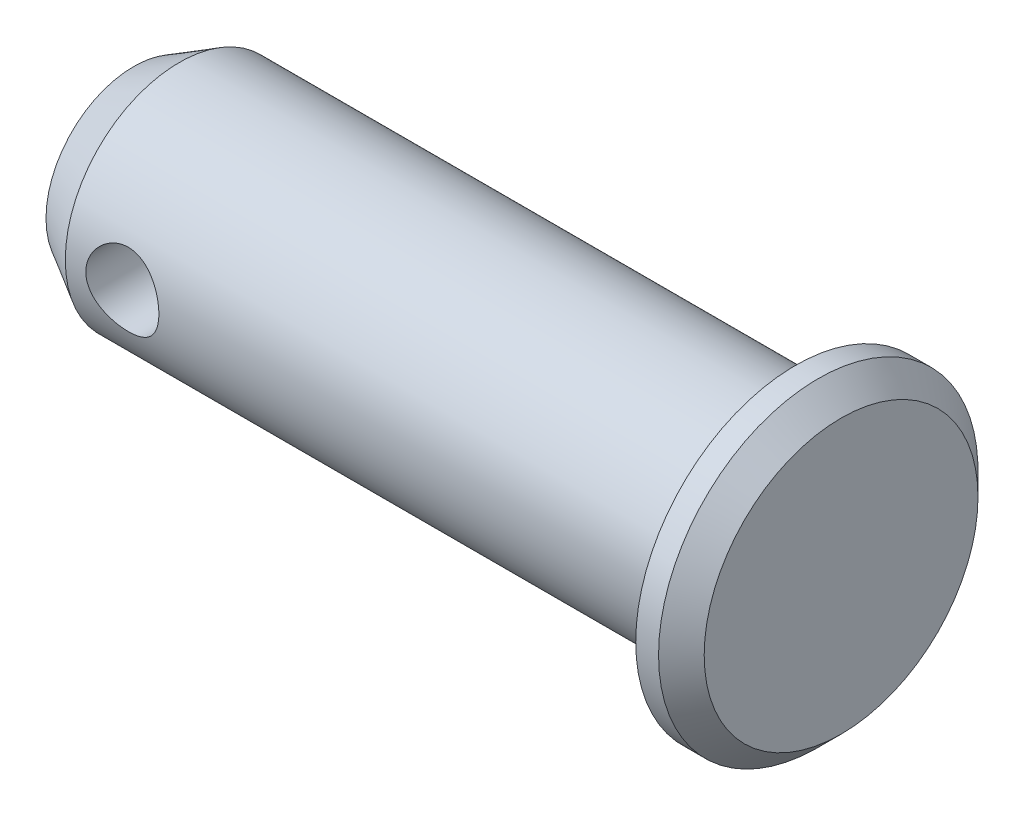
ISO-10303-21;
HEADER;
FILE_DESCRIPTION(('STEP AP214'),'2;1');
FILE_NAME('part.step','',(''),(''),'','','');
FILE_SCHEMA(('AUTOMOTIVE_DESIGN { 1 0 10303 214 1 1 1 1 }'));
ENDSEC;
DATA;
#1=APPLICATION_CONTEXT('core data for automotive mechanical design processes');
#2=APPLICATION_PROTOCOL_DEFINITION('international standard','automotive_design',2000,#1);
#3=PRODUCT_CONTEXT('',#1,'mechanical');
#4=PRODUCT('Part','Part','',(#3));
#5=PRODUCT_RELATED_PRODUCT_CATEGORY('part','',(#4));
#6=PRODUCT_DEFINITION_FORMATION('','',#4);
#7=PRODUCT_DEFINITION_CONTEXT('part definition',#1,'design');
#8=PRODUCT_DEFINITION('design','',#6,#7);
#9=PRODUCT_DEFINITION_SHAPE('','',#8);
#10=(LENGTH_UNIT() NAMED_UNIT(*) SI_UNIT(.MILLI.,.METRE.));
#11=(NAMED_UNIT(*) PLANE_ANGLE_UNIT() SI_UNIT($,.RADIAN.));
#12=(NAMED_UNIT(*) SI_UNIT($,.STERADIAN.) SOLID_ANGLE_UNIT());
#13=UNCERTAINTY_MEASURE_WITH_UNIT(LENGTH_MEASURE(1.E-05),#10,'distance_accuracy_value','');
#14=(GEOMETRIC_REPRESENTATION_CONTEXT(3) GLOBAL_UNCERTAINTY_ASSIGNED_CONTEXT((#13)) GLOBAL_UNIT_ASSIGNED_CONTEXT((#10,
#11,#12)) REPRESENTATION_CONTEXT('',''));
#15=CARTESIAN_POINT('',(0.,0.,0.));
#16=DIRECTION('',(0.,0.,1.));
#17=DIRECTION('',(1.,0.,0.));
#18=AXIS2_PLACEMENT_3D('',#15,#16,#17);
#19=CARTESIAN_POINT('',(-29.,0.,0.));
#20=DIRECTION('',(-1.,0.,0.));
#21=DIRECTION('',(0.,0.,1.));
#22=AXIS2_PLACEMENT_3D('',#19,#20,#21);
#23=PLANE('',#22);
#24=CARTESIAN_POINT('',(-29.,0.,0.));
#25=DIRECTION('',(-1.,0.,0.));
#26=DIRECTION('',(0.,0.,1.));
#27=AXIS2_PLACEMENT_3D('',#24,#25,#26);
#28=CIRCLE('',#27,3.84529946162075);
#29=CARTESIAN_POINT('',(-29.,0.,3.84529946162075));
#30=VERTEX_POINT('',#29);
#31=EDGE_CURVE('E10',#30,#30,#28,.T.);
#32=ORIENTED_EDGE('',*,*,#31,.T.);
#33=EDGE_LOOP('',(#32));
#34=FACE_BOUND('',#33,.T.);
#35=ADVANCED_FACE('F30',(#34),#23,.T.);
#36=CARTESIAN_POINT('',(0.,0.,0.));
#37=DIRECTION('',(1.,0.,0.));
#38=DIRECTION('',(0.,0.,-1.));
#39=AXIS2_PLACEMENT_3D('',#36,#37,#38);
#40=CYLINDRICAL_SURFACE('',#39,5.);
#41=CARTESIAN_POINT('',(-26.1,0.,-5.));
#42=CARTESIAN_POINT('',(-26.0999997563494,0.0874958063159795,-4.99999978543626));
#43=CARTESIAN_POINT('',(-26.0927994047207,0.174994637059061,-4.99768184156355));
#44=CARTESIAN_POINT('',(-26.0642681804707,0.347426901237483,-4.98866262172226));
#45=CARTESIAN_POINT('',(-26.0429347281821,0.432359863373708,-4.98196054553558));
#46=CARTESIAN_POINT('',(-25.9869350787882,0.597149225791565,-4.96490383635409));
#47=CARTESIAN_POINT('',(-25.9522901076294,0.677013473384594,-4.95455502045191));
#48=CARTESIAN_POINT('',(-25.8707431699127,0.829798762851157,-4.93126901642872));
#49=CARTESIAN_POINT('',(-25.8238390942344,0.902718607024946,-4.91833138300385));
#50=CARTESIAN_POINT('',(-25.717515886496,1.04189475779498,-4.89077067933825));
#51=CARTESIAN_POINT('',(-25.6577729010466,1.1078960922464,-4.87610957732918));
#52=CARTESIAN_POINT('',(-25.5281569334526,1.22913423693228,-4.8469706570307));
#53=CARTESIAN_POINT('',(-25.4582819523451,1.28436891793797,-4.83249287552328));
#54=CARTESIAN_POINT('',(-25.3081471454896,1.38391395073832,-4.80494810799029));
#55=CARTESIAN_POINT('',(-25.2276637187295,1.42790123109944,-4.79192785635417));
#56=CARTESIAN_POINT('',(-25.0599576562299,1.5016091713459,-4.76934657798645));
#57=CARTESIAN_POINT('',(-24.9727369020117,1.53133379773326,-4.75978458968016));
#58=CARTESIAN_POINT('',(-24.7969173927271,1.57473134311321,-4.74560122760597));
#59=CARTESIAN_POINT('',(-24.708447898248,1.58887896846385,-4.74083414932744));
#60=CARTESIAN_POINT('',(-24.5302724008155,1.6022043305885,-4.73634831045));
#61=CARTESIAN_POINT('',(-24.440566752148,1.6013862709372,-4.73662813227306));
#62=CARTESIAN_POINT('',(-24.2664344151118,1.58517380736381,-4.74207619100075));
#63=CARTESIAN_POINT('',(-24.1819435465553,1.57038842132725,-4.7470401743042));
#64=CARTESIAN_POINT('',(-24.0167111555779,1.52765058974139,-4.76096457446162));
#65=CARTESIAN_POINT('',(-23.9359700504148,1.49969668269327,-4.76992543490025));
#66=CARTESIAN_POINT('',(-23.7791021411743,1.43099645158812,-4.7909865416364));
#67=CARTESIAN_POINT('',(-23.7030637800485,1.39006273103722,-4.80313229469362));
#68=CARTESIAN_POINT('',(-23.5587379569732,1.29669494334067,-4.82917444861168));
#69=CARTESIAN_POINT('',(-23.4904525972565,1.24425776827155,-4.8430713221454));
#70=CARTESIAN_POINT('',(-23.3601353271337,1.12640551540387,-4.87186372141871));
#71=CARTESIAN_POINT('',(-23.2985592230612,1.06048936249402,-4.8867752080818));
#72=CARTESIAN_POINT('',(-23.1872213217664,0.919081432217147,-4.91533168114877));
#73=CARTESIAN_POINT('',(-23.1374604868571,0.843588875652691,-4.92897656433707));
#74=CARTESIAN_POINT('',(-23.0508365567198,0.684261580712369,-4.95361789744584));
#75=CARTESIAN_POINT('',(-23.0140868991636,0.600361279440631,-4.96459080547942));
#76=CARTESIAN_POINT('',(-22.9553604033373,0.427135850361127,-4.98248161100196));
#77=CARTESIAN_POINT('',(-22.9333788521833,0.337812463131544,-4.98940080204637));
#78=CARTESIAN_POINT('',(-22.9055999333348,0.160141789589313,-4.99819424239134));
#79=CARTESIAN_POINT('',(-22.8991859263889,0.0719002860170688,-5.00026060178154));
#80=CARTESIAN_POINT('',(-22.9009792182213,-0.104410269588111,-4.99968655318444));
#81=CARTESIAN_POINT('',(-22.9091842653099,-0.192479346087445,-4.99704687004206));
#82=CARTESIAN_POINT('',(-22.9394901130812,-0.363535018203817,-4.98748380317496));
#83=CARTESIAN_POINT('',(-22.9612199100859,-0.446594362478028,-4.98067486649266));
#84=CARTESIAN_POINT('',(-23.0175017993962,-0.607861654600588,-4.96357585995348));
#85=CARTESIAN_POINT('',(-23.0520554966022,-0.686068993794131,-4.95328535439546));
#86=CARTESIAN_POINT('',(-23.1339710171782,-0.837596923870451,-4.92995531019905));
#87=CARTESIAN_POINT('',(-23.1816325119423,-0.910745620500972,-4.9168532627009));
#88=CARTESIAN_POINT('',(-23.2880538729856,-1.04821150300662,-4.8893940824048));
#89=CARTESIAN_POINT('',(-23.3468168864583,-1.11252617555399,-4.87503659432078));
#90=CARTESIAN_POINT('',(-23.476674159611,-1.23328321488636,-4.84592967283237));
#91=CARTESIAN_POINT('',(-23.5481802676885,-1.28928579475621,-4.83118884166735));
#92=CARTESIAN_POINT('',(-23.6998946744582,-1.3885414199257,-4.80360443110144));
#93=CARTESIAN_POINT('',(-23.780102901454,-1.43179457025642,-4.79076083607138));
#94=CARTESIAN_POINT('',(-23.9468435786561,-1.50407580301232,-4.76856262886575));
#95=CARTESIAN_POINT('',(-24.0333541349897,-1.53315066307446,-4.75919656820051));
#96=CARTESIAN_POINT('',(-24.2104072098103,-1.57620668246202,-4.74511281699328));
#97=CARTESIAN_POINT('',(-24.300948081136,-1.59019395006567,-4.74039324536733));
#98=CARTESIAN_POINT('',(-24.478875969164,-1.60222535311567,-4.73633927898768));
#99=CARTESIAN_POINT('',(-24.566209011329,-1.60099388446007,-4.73676019091382));
#100=CARTESIAN_POINT('',(-24.7393570054347,-1.58438355149371,-4.74234159093745));
#101=CARTESIAN_POINT('',(-24.825172034561,-1.56900540861121,-4.74750183734631));
#102=CARTESIAN_POINT('',(-24.9914834253769,-1.52503332416462,-4.76180543144415));
#103=CARTESIAN_POINT('',(-25.0720431988929,-1.49665627942707,-4.77088327236762));
#104=CARTESIAN_POINT('',(-25.2273217604008,-1.42766427484382,-4.79197975594362));
#105=CARTESIAN_POINT('',(-25.3020393157627,-1.38704674114626,-4.80399901699919));
#106=CARTESIAN_POINT('',(-25.4468096298144,-1.29279266707433,-4.83023494368376));
#107=CARTESIAN_POINT('',(-25.516548262734,-1.23869308431579,-4.8445211905268));
#108=CARTESIAN_POINT('',(-25.646191745821,-1.11981399792885,-4.87337180847353));
#109=CARTESIAN_POINT('',(-25.7060939051986,-1.05503158166823,-4.88793625446695));
#110=CARTESIAN_POINT('',(-25.8164582859238,-0.913912210298355,-4.91631108200117));
#111=CARTESIAN_POINT('',(-25.8665189518843,-0.837251351760783,-4.93007751880385));
#112=CARTESIAN_POINT('',(-25.9529801880972,-0.67616352992694,-4.9547378769786));
#113=CARTESIAN_POINT('',(-25.9893854793208,-0.59173926320816,-4.96563279071293));
#114=CARTESIAN_POINT('',(-26.0452477798304,-0.423663431644848,-4.98268341064065));
#115=CARTESIAN_POINT('',(-26.0657184505831,-0.340376766487332,-4.9891190130145));
#116=CARTESIAN_POINT('',(-26.093093142904,-0.17139400107612,-4.99777693541394));
#117=CARTESIAN_POINT('',(-26.1000002386455,-0.0856984512613952,-5.00000021015612));
#118=CARTESIAN_POINT('',(-26.1,0.,-5.));
#119=B_SPLINE_CURVE_WITH_KNOTS('',3,(#41,#42,#43,#44,#45,#46,#47,#48,#49,#50,#51,#52,#53,#54,
#55,#56,#57,#58,#59,#60,#61,#62,#63,#64,#65,#66,#67,#68,#69,#70,#71,#72,#73,#74,#75,#76,#77,#78,
#79,#80,#81,#82,#83,#84,#85,#86,#87,#88,#89,#90,#91,#92,#93,#94,#95,#96,#97,#98,#99,#100,#101,
#102,#103,#104,#105,#106,#107,#108,#109,#110,#111,#112,#113,#114,#115,#116,#117,#118),
.UNSPECIFIED.,.T.,.F.,(4,2,2,2,2,2,2,2,2,2,2,2,2,2,2,2,2,2,2,2,2,2,2,2,2,2,2,2,2,2,2,2,2,2,2,2,
2,2,4),(0.,0.262172289866487,0.524392446348364,0.786196202111711,1.04804502964703,
1.31749718151567,1.58700256668426,1.86354828826627,2.14001705671955,2.40780489999507,
2.67551752794223,2.93207089351446,3.18865273918779,3.44912195934764,3.70966163813009,
3.98267284808623,4.25570628624555,4.53106471334195,4.80633522466349,5.07051010591345,
5.33464430132699,5.59183416387789,5.84905622438334,6.11273355055082,6.37648573964819,
6.6512299305306,6.92597185797943,7.19980110675105,7.47351945288796,7.73426134972848,
7.99498995042989,8.25151822881317,8.50810048600705,8.77513756675923,9.04224757485584,
9.31866285531261,9.59498248449731,9.85182740305348,10.1086141011962),.UNSPECIFIED.);
#120=CARTESIAN_POINT('',(-26.1,0.,-5.));
#121=VERTEX_POINT('',#120);
#122=EDGE_CURVE('E34',#121,#121,#119,.T.);
#123=ORIENTED_EDGE('',*,*,#122,.F.);
#124=EDGE_LOOP('',(#123));
#125=FACE_BOUND('',#124,.T.);
#126=CARTESIAN_POINT('',(-22.9,0.,5.));
#127=CARTESIAN_POINT('',(-22.9000002436506,0.0874958063159768,4.99999978543626));
#128=CARTESIAN_POINT('',(-22.9072005952793,0.174994637059058,4.99768184156355));
#129=CARTESIAN_POINT('',(-22.9357318195293,0.34742690123748,4.98866262172226));
#130=CARTESIAN_POINT('',(-22.9570652718179,0.432359863373706,4.98196054553558));
#131=CARTESIAN_POINT('',(-23.0130649212118,0.597149225791563,4.96490383635409));
#132=CARTESIAN_POINT('',(-23.0477098923706,0.677013473384593,4.95455502045191));
#133=CARTESIAN_POINT('',(-23.1292568300873,0.829798762851154,4.93126901642872));
#134=CARTESIAN_POINT('',(-23.1761609057656,0.902718607024943,4.91833138300385));
#135=CARTESIAN_POINT('',(-23.282484113504,1.04189475779498,4.89077067933825));
#136=CARTESIAN_POINT('',(-23.3422270989534,1.1078960922464,4.87610957732918));
#137=CARTESIAN_POINT('',(-23.4718430665474,1.22913423693228,4.8469706570307));
#138=CARTESIAN_POINT('',(-23.5417180476549,1.28436891793797,4.83249287552328));
#139=CARTESIAN_POINT('',(-23.6918528545104,1.38391395073831,4.80494810799029));
#140=CARTESIAN_POINT('',(-23.7723362812705,1.42790123109944,4.79192785635417));
#141=CARTESIAN_POINT('',(-23.9400423437701,1.5016091713459,4.76934657798645));
#142=CARTESIAN_POINT('',(-24.0272630979883,1.53133379773326,4.75978458968016));
#143=CARTESIAN_POINT('',(-24.2030826072729,1.57473134311321,4.74560122760597));
#144=CARTESIAN_POINT('',(-24.291552101752,1.58887896846385,4.74083414932744));
#145=CARTESIAN_POINT('',(-24.4697275991845,1.6022043305885,4.73634831045));
#146=CARTESIAN_POINT('',(-24.559433247852,1.6013862709372,4.73662813227306));
#147=CARTESIAN_POINT('',(-24.7335655848882,1.58517380736381,4.74207619100075));
#148=CARTESIAN_POINT('',(-24.8180564534447,1.57038842132725,4.7470401743042));
#149=CARTESIAN_POINT('',(-24.9832888444221,1.52765058974139,4.76096457446162));
#150=CARTESIAN_POINT('',(-25.0640299495852,1.49969668269327,4.76992543490025));
#151=CARTESIAN_POINT('',(-25.2208978588257,1.43099645158812,4.7909865416364));
#152=CARTESIAN_POINT('',(-25.2969362199515,1.39006273103722,4.80313229469362));
#153=CARTESIAN_POINT('',(-25.4412620430268,1.29669494334067,4.82917444861168));
#154=CARTESIAN_POINT('',(-25.5095474027435,1.24425776827155,4.8430713221454));
#155=CARTESIAN_POINT('',(-25.6398646728663,1.12640551540387,4.87186372141871));
#156=CARTESIAN_POINT('',(-25.7014407769388,1.06048936249402,4.8867752080818));
#157=CARTESIAN_POINT('',(-25.8127786782337,0.919081432217147,4.91533168114877));
#158=CARTESIAN_POINT('',(-25.8625395131429,0.843588875652693,4.92897656433707));
#159=CARTESIAN_POINT('',(-25.9491634432802,0.684261580712373,4.95361789744584));
#160=CARTESIAN_POINT('',(-25.9859131008364,0.600361279440633,4.96459080547942));
#161=CARTESIAN_POINT('',(-26.0446395966627,0.427135850361127,4.98248161100196));
#162=CARTESIAN_POINT('',(-26.0666211478167,0.337812463131545,4.98940080204637));
#163=CARTESIAN_POINT('',(-26.0944000666652,0.160141789589315,4.99819424239134));
#164=CARTESIAN_POINT('',(-26.1008140736111,0.0719002860170705,5.00026060178154));
#165=CARTESIAN_POINT('',(-26.0990207817787,-0.104410269588109,4.99968655318444));
#166=CARTESIAN_POINT('',(-26.0908157346901,-0.192479346087443,4.99704687004206));
#167=CARTESIAN_POINT('',(-26.0605098869188,-0.363535018203816,4.98748380317496));
#168=CARTESIAN_POINT('',(-26.0387800899141,-0.446594362478026,4.98067486649266));
#169=CARTESIAN_POINT('',(-25.9824982006038,-0.607861654600586,4.96357585995348));
#170=CARTESIAN_POINT('',(-25.9479445033978,-0.686068993794128,4.95328535439546));
#171=CARTESIAN_POINT('',(-25.8660289828219,-0.837596923870449,4.92995531019904));
#172=CARTESIAN_POINT('',(-25.8183674880577,-0.91074562050097,4.9168532627009));
#173=CARTESIAN_POINT('',(-25.7119461270144,-1.04821150300662,4.8893940824048));
#174=CARTESIAN_POINT('',(-25.6531831135417,-1.11252617555399,4.87503659432078));
#175=CARTESIAN_POINT('',(-25.523325840389,-1.23328321488636,4.84592967283237));
#176=CARTESIAN_POINT('',(-25.4518197323115,-1.28928579475621,4.83118884166735));
#177=CARTESIAN_POINT('',(-25.3001053255418,-1.3885414199257,4.80360443110144));
#178=CARTESIAN_POINT('',(-25.219897098546,-1.43179457025642,4.79076083607138));
#179=CARTESIAN_POINT('',(-25.0531564213439,-1.50407580301232,4.76856262886575));
#180=CARTESIAN_POINT('',(-24.9666458650103,-1.53315066307446,4.75919656820051));
#181=CARTESIAN_POINT('',(-24.7895927901897,-1.57620668246202,4.74511281699328));
#182=CARTESIAN_POINT('',(-24.699051918864,-1.59019395006567,4.74039324536733));
#183=CARTESIAN_POINT('',(-24.521124030836,-1.60222535311567,4.73633927898768));
#184=CARTESIAN_POINT('',(-24.433790988671,-1.60099388446007,4.73676019091382));
#185=CARTESIAN_POINT('',(-24.2606429945653,-1.58438355149371,4.74234159093745));
#186=CARTESIAN_POINT('',(-24.174827965439,-1.56900540861122,4.74750183734631));
#187=CARTESIAN_POINT('',(-24.0085165746231,-1.52503332416462,4.76180543144415));
#188=CARTESIAN_POINT('',(-23.9279568011071,-1.49665627942707,4.77088327236762));
#189=CARTESIAN_POINT('',(-23.7726782395992,-1.42766427484383,4.79197975594361));
#190=CARTESIAN_POINT('',(-23.6979606842373,-1.38704674114626,4.80399901699919));
#191=CARTESIAN_POINT('',(-23.5531903701856,-1.29279266707433,4.83023494368376));
#192=CARTESIAN_POINT('',(-23.483451737266,-1.23869308431579,4.8445211905268));
#193=CARTESIAN_POINT('',(-23.353808254179,-1.11981399792885,4.87337180847353));
#194=CARTESIAN_POINT('',(-23.2939060948014,-1.05503158166824,4.88793625446695));
#195=CARTESIAN_POINT('',(-23.1835417140762,-0.913912210298358,4.91631108200116));
#196=CARTESIAN_POINT('',(-23.1334810481157,-0.837251351760786,4.93007751880385));
#197=CARTESIAN_POINT('',(-23.0470198119028,-0.676163529926942,4.9547378769786));
#198=CARTESIAN_POINT('',(-23.0106145206792,-0.591739263208162,4.96563279071293));
#199=CARTESIAN_POINT('',(-22.9547522201696,-0.423663431644849,4.98268341064065));
#200=CARTESIAN_POINT('',(-22.9342815494169,-0.340376766487334,4.9891190130145));
#201=CARTESIAN_POINT('',(-22.906906857096,-0.171394001076123,4.99777693541394));
#202=CARTESIAN_POINT('',(-22.8999997613545,-0.085698451261398,5.00000021015612));
#203=CARTESIAN_POINT('',(-22.9,0.,5.));
#204=B_SPLINE_CURVE_WITH_KNOTS('',3,(#126,#127,#128,#129,#130,#131,#132,#133,#134,#135,#136,
#137,#138,#139,#140,#141,#142,#143,#144,#145,#146,#147,#148,#149,#150,#151,#152,#153,#154,#155,
#156,#157,#158,#159,#160,#161,#162,#163,#164,#165,#166,#167,#168,#169,#170,#171,#172,#173,#174,
#175,#176,#177,#178,#179,#180,#181,#182,#183,#184,#185,#186,#187,#188,#189,#190,#191,#192,#193,
#194,#195,#196,#197,#198,#199,#200,#201,#202,#203),.UNSPECIFIED.,.T.,.F.,(4,2,2,2,2,2,2,2,2,2,2,
2,2,2,2,2,2,2,2,2,2,2,2,2,2,2,2,2,2,2,2,2,2,2,2,2,2,2,4),(0.,0.262172289866488,
0.524392446348365,0.786196202111712,1.04804502964703,1.31749718151567,1.58700256668426,
1.86354828826627,2.14001705671955,2.40780489999507,2.67551752794224,2.93207089351446,
3.18865273918779,3.44912195934764,3.70966163813009,3.98267284808624,4.25570628624555,
4.53106471334195,4.80633522466349,5.07051010591345,5.33464430132699,5.59183416387789,
5.84905622438334,6.11273355055082,6.37648573964819,6.6512299305306,6.92597185797943,
7.19980110675105,7.47351945288796,7.73426134972848,7.99498995042988,8.25151822881316,
8.50810048600705,8.77513756675923,9.04224757485584,9.3186628553126,9.59498248449731,
9.85182740305348,10.1086141011962),.UNSPECIFIED.);
#205=CARTESIAN_POINT('',(-22.9,0.,5.));
#206=VERTEX_POINT('',#205);
#207=EDGE_CURVE('E51',#206,#206,#204,.T.);
#208=ORIENTED_EDGE('',*,*,#207,.F.);
#209=EDGE_LOOP('',(#208));
#210=FACE_BOUND('',#209,.T.);
#211=CARTESIAN_POINT('',(-27.,0.,0.));
#212=DIRECTION('',(-1.,0.,0.));
#213=DIRECTION('',(0.,0.,1.));
#214=AXIS2_PLACEMENT_3D('',#211,#212,#213);
#215=CIRCLE('',#214,5.);
#216=CARTESIAN_POINT('',(-27.,0.,5.));
#217=VERTEX_POINT('',#216);
#218=EDGE_CURVE('E43',#217,#217,#215,.F.);
#219=ORIENTED_EDGE('',*,*,#218,.T.);
#220=EDGE_LOOP('',(#219));
#221=FACE_BOUND('',#220,.T.);
#222=CARTESIAN_POINT('',(0.,0.,0.));
#223=DIRECTION('',(1.,0.,0.));
#224=DIRECTION('',(0.,0.,-1.));
#225=AXIS2_PLACEMENT_3D('',#222,#223,#224);
#226=CIRCLE('',#225,5.);
#227=CARTESIAN_POINT('',(0.,0.,-5.));
#228=VERTEX_POINT('',#227);
#229=EDGE_CURVE('E48',#228,#228,#226,.T.);
#230=ORIENTED_EDGE('',*,*,#229,.F.);
#231=EDGE_LOOP('',(#230));
#232=FACE_BOUND('',#231,.T.);
#233=ADVANCED_FACE('F56',(#125,#210,#221,#232),#40,.T.);
#234=CARTESIAN_POINT('',(0.,0.,0.));
#235=DIRECTION('',(1.,0.,0.));
#236=DIRECTION('',(0.,0.,-1.));
#237=AXIS2_PLACEMENT_3D('',#234,#235,#236);
#238=PLANE('',#237);
#239=ORIENTED_EDGE('',*,*,#229,.T.);
#240=EDGE_LOOP('',(#239));
#241=FACE_BOUND('',#240,.T.);
#242=CARTESIAN_POINT('',(0.,0.,0.));
#243=DIRECTION('',(-1.,0.,0.));
#244=DIRECTION('',(0.,0.,1.));
#245=AXIS2_PLACEMENT_3D('',#242,#243,#244);
#246=CIRCLE('',#245,7.);
#247=CARTESIAN_POINT('',(0.,0.,7.));
#248=VERTEX_POINT('',#247);
#249=EDGE_CURVE('E137',#248,#248,#246,.T.);
#250=ORIENTED_EDGE('',*,*,#249,.T.);
#251=EDGE_LOOP('',(#250));
#252=FACE_BOUND('',#251,.T.);
#253=ADVANCED_FACE('F75',(#241,#252),#238,.F.);
#254=CARTESIAN_POINT('',(0.,0.,0.));
#255=DIRECTION('',(-1.,0.,0.));
#256=DIRECTION('',(0.,0.,1.));
#257=AXIS2_PLACEMENT_3D('',#254,#255,#256);
#258=CYLINDRICAL_SURFACE('',#257,7.);
#259=ORIENTED_EDGE('',*,*,#249,.F.);
#260=EDGE_LOOP('',(#259));
#261=FACE_BOUND('',#260,.T.);
#262=CARTESIAN_POINT('',(1.,0.,0.));
#263=DIRECTION('',(-1.,0.,0.));
#264=DIRECTION('',(0.,0.,1.));
#265=AXIS2_PLACEMENT_3D('',#262,#263,#264);
#266=CIRCLE('',#265,7.);
#267=CARTESIAN_POINT('',(1.,0.,7.));
#268=VERTEX_POINT('',#267);
#269=EDGE_CURVE('E139',#268,#268,#266,.T.);
#270=ORIENTED_EDGE('',*,*,#269,.T.);
#271=EDGE_LOOP('',(#270));
#272=FACE_BOUND('',#271,.T.);
#273=ADVANCED_FACE('F72',(#261,#272),#258,.T.);
#274=CARTESIAN_POINT('',(2.,0.,0.));
#275=DIRECTION('',(-1.,0.,0.));
#276=DIRECTION('',(0.,0.,1.));
#277=AXIS2_PLACEMENT_3D('',#274,#275,#276);
#278=CONICAL_SURFACE('',#277,6.,0.785398163397448);
#279=ORIENTED_EDGE('',*,*,#269,.F.);
#280=EDGE_LOOP('',(#279));
#281=FACE_BOUND('',#280,.T.);
#282=CARTESIAN_POINT('',(2.,0.,0.));
#283=DIRECTION('',(-1.,0.,0.));
#284=DIRECTION('',(0.,0.,1.));
#285=AXIS2_PLACEMENT_3D('',#282,#283,#284);
#286=CIRCLE('',#285,6.);
#287=CARTESIAN_POINT('',(2.,0.,6.));
#288=VERTEX_POINT('',#287);
#289=EDGE_CURVE('E144',#288,#288,#286,.T.);
#290=ORIENTED_EDGE('',*,*,#289,.T.);
#291=EDGE_LOOP('',(#290));
#292=FACE_BOUND('',#291,.T.);
#293=ADVANCED_FACE('F68',(#281,#292),#278,.T.);
#294=CARTESIAN_POINT('',(2.,0.,0.));
#295=DIRECTION('',(-1.,0.,0.));
#296=DIRECTION('',(0.,0.,1.));
#297=AXIS2_PLACEMENT_3D('',#294,#295,#296);
#298=PLANE('',#297);
#299=ORIENTED_EDGE('',*,*,#289,.F.);
#300=EDGE_LOOP('',(#299));
#301=FACE_BOUND('',#300,.T.);
#302=ADVANCED_FACE('F64',(#301),#298,.F.);
#303=CARTESIAN_POINT('',(-27.,0.,0.));
#304=DIRECTION('',(1.,0.,0.));
#305=DIRECTION('',(0.,0.,-1.));
#306=AXIS2_PLACEMENT_3D('',#303,#304,#305);
#307=CONICAL_SURFACE('',#306,5.,0.523598775598296);
#308=ORIENTED_EDGE('',*,*,#31,.F.);
#309=EDGE_LOOP('',(#308));
#310=FACE_BOUND('',#309,.T.);
#311=ORIENTED_EDGE('',*,*,#218,.F.);
#312=EDGE_LOOP('',(#311));
#313=FACE_BOUND('',#312,.T.);
#314=ADVANCED_FACE('F32',(#310,#313),#307,.T.);
#315=CARTESIAN_POINT('',(-24.5,0.,-7.));
#316=DIRECTION('',(0.,0.,1.));
#317=DIRECTION('',(1.,0.,0.));
#318=AXIS2_PLACEMENT_3D('',#315,#316,#317);
#319=CYLINDRICAL_SURFACE('',#318,1.6);
#320=ORIENTED_EDGE('',*,*,#122,.T.);
#321=EDGE_LOOP('',(#320));
#322=FACE_BOUND('',#321,.T.);
#323=ORIENTED_EDGE('',*,*,#207,.T.);
#324=EDGE_LOOP('',(#323));
#325=FACE_BOUND('',#324,.T.);
#326=ADVANCED_FACE('F59',(#322,#325),#319,.F.);
#327=CLOSED_SHELL('',(#35,#233,#253,#273,#293,#302,#314,#326));
#328=MANIFOLD_SOLID_BREP('B2',#327);
#329=ADVANCED_BREP_SHAPE_REPRESENTATION('',(#18,#328),#14);
#330=SHAPE_DEFINITION_REPRESENTATION(#9,#329);
ENDSEC;
END-ISO-10303-21;
